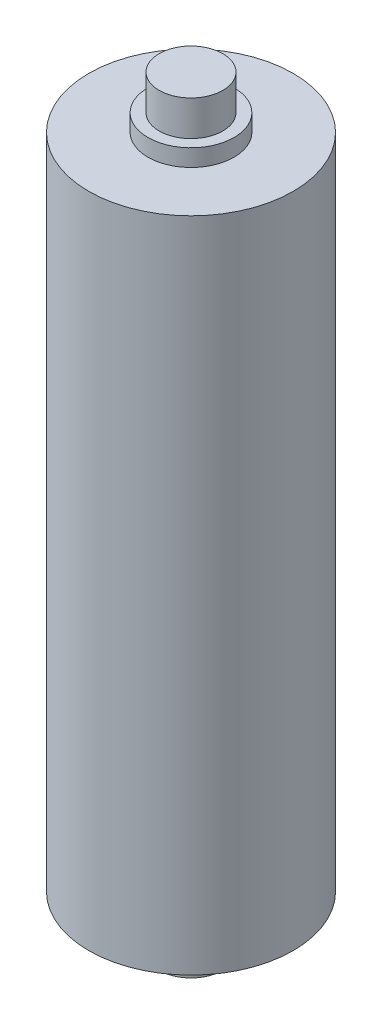
ISO-10303-21;
HEADER;
FILE_DESCRIPTION(('STEP AP214'),'2;1');
FILE_NAME('part.step','',(''),(''),'','','');
FILE_SCHEMA(('AUTOMOTIVE_DESIGN { 1 0 10303 214 1 1 1 1 }'));
ENDSEC;
DATA;
#1=APPLICATION_CONTEXT('core data for automotive mechanical design processes');
#2=APPLICATION_PROTOCOL_DEFINITION('international standard','automotive_design',2000,#1);
#3=PRODUCT_CONTEXT('',#1,'mechanical');
#4=PRODUCT('Part','Part','',(#3));
#5=PRODUCT_RELATED_PRODUCT_CATEGORY('part','',(#4));
#6=PRODUCT_DEFINITION_FORMATION('','',#4);
#7=PRODUCT_DEFINITION_CONTEXT('part definition',#1,'design');
#8=PRODUCT_DEFINITION('design','',#6,#7);
#9=PRODUCT_DEFINITION_SHAPE('','',#8);
#10=(LENGTH_UNIT() NAMED_UNIT(*) SI_UNIT(.MILLI.,.METRE.));
#11=(NAMED_UNIT(*) PLANE_ANGLE_UNIT() SI_UNIT($,.RADIAN.));
#12=(NAMED_UNIT(*) SI_UNIT($,.STERADIAN.) SOLID_ANGLE_UNIT());
#13=UNCERTAINTY_MEASURE_WITH_UNIT(LENGTH_MEASURE(1.E-05),#10,'distance_accuracy_value','');
#14=(GEOMETRIC_REPRESENTATION_CONTEXT(3) GLOBAL_UNCERTAINTY_ASSIGNED_CONTEXT((#13)) GLOBAL_UNIT_ASSIGNED_CONTEXT((#10,
#11,#12)) REPRESENTATION_CONTEXT('',''));
#15=CARTESIAN_POINT('',(0.,0.,0.));
#16=DIRECTION('',(0.,0.,1.));
#17=DIRECTION('',(1.,0.,0.));
#18=AXIS2_PLACEMENT_3D('',#15,#16,#17);
#19=CARTESIAN_POINT('',(0.,51.6,0.));
#20=DIRECTION('',(0.,-1.,0.));
#21=DIRECTION('',(0.,0.,-1.));
#22=AXIS2_PLACEMENT_3D('',#19,#20,#21);
#23=CYLINDRICAL_SURFACE('',#22,6.425);
#24=CARTESIAN_POINT('',(0.,49.05,0.));
#25=DIRECTION('',(0.,1.,0.));
#26=DIRECTION('',(0.,0.,1.));
#27=AXIS2_PLACEMENT_3D('',#24,#25,#26);
#28=CIRCLE('',#27,6.425);
#29=CARTESIAN_POINT('',(0.,49.05,6.425));
#30=VERTEX_POINT('',#29);
#31=EDGE_CURVE('E64',#30,#30,#28,.T.);
#32=ORIENTED_EDGE('',*,*,#31,.T.);
#33=EDGE_LOOP('',(#32));
#34=FACE_BOUND('',#33,.T.);
#35=CARTESIAN_POINT('',(0.,51.6,0.));
#36=DIRECTION('',(0.,1.,0.));
#37=DIRECTION('',(0.,0.,1.));
#38=AXIS2_PLACEMENT_3D('',#35,#36,#37);
#39=CIRCLE('',#38,6.425);
#40=CARTESIAN_POINT('',(0.,51.6,6.425));
#41=VERTEX_POINT('',#40);
#42=EDGE_CURVE('E42',#41,#41,#39,.T.);
#43=ORIENTED_EDGE('',*,*,#42,.F.);
#44=EDGE_LOOP('',(#43));
#45=FACE_BOUND('',#44,.T.);
#46=ADVANCED_FACE('F32',(#34,#45),#23,.T.);
#47=CARTESIAN_POINT('',(0.,51.6,0.));
#48=DIRECTION('',(0.,1.,0.));
#49=DIRECTION('',(0.,0.,1.));
#50=AXIS2_PLACEMENT_3D('',#47,#48,#49);
#51=PLANE('',#50);
#52=CARTESIAN_POINT('',(0.,51.6,0.));
#53=DIRECTION('',(0.,1.,0.));
#54=DIRECTION('',(0.,0.,1.));
#55=AXIS2_PLACEMENT_3D('',#52,#53,#54);
#56=CIRCLE('',#55,4.75);
#57=CARTESIAN_POINT('',(0.,51.6,4.75));
#58=VERTEX_POINT('',#57);
#59=EDGE_CURVE('E50',#58,#58,#56,.F.);
#60=ORIENTED_EDGE('',*,*,#59,.T.);
#61=EDGE_LOOP('',(#60));
#62=FACE_BOUND('',#61,.T.);
#63=ORIENTED_EDGE('',*,*,#42,.T.);
#64=EDGE_LOOP('',(#63));
#65=FACE_BOUND('',#64,.T.);
#66=ADVANCED_FACE('F96',(#62,#65),#51,.T.);
#67=CARTESIAN_POINT('',(0.,56.85,0.));
#68=DIRECTION('',(0.,-1.,0.));
#69=DIRECTION('',(0.,0.,-1.));
#70=AXIS2_PLACEMENT_3D('',#67,#68,#69);
#71=CYLINDRICAL_SURFACE('',#70,4.75);
#72=ORIENTED_EDGE('',*,*,#59,.F.);
#73=EDGE_LOOP('',(#72));
#74=FACE_BOUND('',#73,.T.);
#75=CARTESIAN_POINT('',(0.,56.85,0.));
#76=DIRECTION('',(0.,1.,0.));
#77=DIRECTION('',(0.,0.,1.));
#78=AXIS2_PLACEMENT_3D('',#75,#76,#77);
#79=CIRCLE('',#78,4.75);
#80=CARTESIAN_POINT('',(0.,56.85,4.75));
#81=VERTEX_POINT('',#80);
#82=EDGE_CURVE('E54',#81,#81,#79,.T.);
#83=ORIENTED_EDGE('',*,*,#82,.F.);
#84=EDGE_LOOP('',(#83));
#85=FACE_BOUND('',#84,.T.);
#86=ADVANCED_FACE('F101',(#74,#85),#71,.T.);
#87=CARTESIAN_POINT('',(0.,56.85,0.));
#88=DIRECTION('',(0.,1.,0.));
#89=DIRECTION('',(0.,0.,1.));
#90=AXIS2_PLACEMENT_3D('',#87,#88,#89);
#91=PLANE('',#90);
#92=ORIENTED_EDGE('',*,*,#82,.T.);
#93=EDGE_LOOP('',(#92));
#94=FACE_BOUND('',#93,.T.);
#95=ADVANCED_FACE('F82',(#94),#91,.T.);
#96=CARTESIAN_POINT('',(0.,49.05,0.));
#97=DIRECTION('',(0.,-1.,0.));
#98=DIRECTION('',(0.,0.,-1.));
#99=AXIS2_PLACEMENT_3D('',#96,#97,#98);
#100=CYLINDRICAL_SURFACE('',#99,15.25);
#101=CARTESIAN_POINT('',(0.,49.05,0.));
#102=DIRECTION('',(0.,1.,0.));
#103=DIRECTION('',(0.,0.,1.));
#104=AXIS2_PLACEMENT_3D('',#101,#102,#103);
#105=CIRCLE('',#104,15.25);
#106=CARTESIAN_POINT('',(0.,49.05,15.25));
#107=VERTEX_POINT('',#106);
#108=EDGE_CURVE('E58',#107,#107,#105,.T.);
#109=ORIENTED_EDGE('',*,*,#108,.F.);
#110=EDGE_LOOP('',(#109));
#111=FACE_BOUND('',#110,.T.);
#112=CARTESIAN_POINT('',(0.,-49.05,0.));
#113=DIRECTION('',(0.,1.,0.));
#114=DIRECTION('',(0.,0.,1.));
#115=AXIS2_PLACEMENT_3D('',#112,#113,#114);
#116=CIRCLE('',#115,15.25);
#117=CARTESIAN_POINT('',(0.,-49.05,15.25));
#118=VERTEX_POINT('',#117);
#119=EDGE_CURVE('E61',#118,#118,#116,.T.);
#120=ORIENTED_EDGE('',*,*,#119,.T.);
#121=EDGE_LOOP('',(#120));
#122=FACE_BOUND('',#121,.T.);
#123=ADVANCED_FACE('F76',(#111,#122),#100,.T.);
#124=CARTESIAN_POINT('',(0.,49.05,0.));
#125=DIRECTION('',(0.,1.,0.));
#126=DIRECTION('',(0.,0.,1.));
#127=AXIS2_PLACEMENT_3D('',#124,#125,#126);
#128=PLANE('',#127);
#129=ORIENTED_EDGE('',*,*,#31,.F.);
#130=EDGE_LOOP('',(#129));
#131=FACE_BOUND('',#130,.T.);
#132=ORIENTED_EDGE('',*,*,#108,.T.);
#133=EDGE_LOOP('',(#132));
#134=FACE_BOUND('',#133,.T.);
#135=ADVANCED_FACE('F72',(#131,#134),#128,.T.);
#136=CARTESIAN_POINT('',(0.,-49.05,0.));
#137=DIRECTION('',(0.,1.,0.));
#138=DIRECTION('',(0.,0.,1.));
#139=AXIS2_PLACEMENT_3D('',#136,#137,#138);
#140=PLANE('',#139);
#141=CARTESIAN_POINT('',(0.,-49.05,0.));
#142=DIRECTION('',(0.,1.,0.));
#143=DIRECTION('',(0.,0.,1.));
#144=AXIS2_PLACEMENT_3D('',#141,#142,#143);
#145=CIRCLE('',#144,6.425);
#146=CARTESIAN_POINT('',(0.,-49.05,6.425));
#147=VERTEX_POINT('',#146);
#148=EDGE_CURVE('E10',#147,#147,#145,.T.);
#149=ORIENTED_EDGE('',*,*,#148,.T.);
#150=EDGE_LOOP('',(#149));
#151=FACE_BOUND('',#150,.T.);
#152=ORIENTED_EDGE('',*,*,#119,.F.);
#153=EDGE_LOOP('',(#152));
#154=FACE_BOUND('',#153,.T.);
#155=ADVANCED_FACE('F75',(#151,#154),#140,.F.);
#156=CARTESIAN_POINT('',(0.,-56.85,0.));
#157=DIRECTION('',(0.,1.,0.));
#158=DIRECTION('',(0.,0.,1.));
#159=AXIS2_PLACEMENT_3D('',#156,#157,#158);
#160=PLANE('',#159);
#161=CARTESIAN_POINT('',(0.,-56.85,0.));
#162=DIRECTION('',(0.,1.,0.));
#163=DIRECTION('',(0.,0.,1.));
#164=AXIS2_PLACEMENT_3D('',#161,#162,#163);
#165=CIRCLE('',#164,4.75);
#166=CARTESIAN_POINT('',(0.,-56.85,4.75));
#167=VERTEX_POINT('',#166);
#168=EDGE_CURVE('E55',#167,#167,#165,.T.);
#169=ORIENTED_EDGE('',*,*,#168,.F.);
#170=EDGE_LOOP('',(#169));
#171=FACE_BOUND('',#170,.T.);
#172=ADVANCED_FACE('F87',(#171),#160,.F.);
#173=ORIENTED_EDGE('',*,*,#168,.T.);
#174=EDGE_LOOP('',(#173));
#175=FACE_BOUND('',#174,.T.);
#176=CARTESIAN_POINT('',(0.,-51.6,0.));
#177=DIRECTION('',(0.,1.,0.));
#178=DIRECTION('',(0.,0.,1.));
#179=AXIS2_PLACEMENT_3D('',#176,#177,#178);
#180=CIRCLE('',#179,4.75);
#181=CARTESIAN_POINT('',(0.,-51.6,4.75));
#182=VERTEX_POINT('',#181);
#183=EDGE_CURVE('E38',#182,#182,#180,.F.);
#184=ORIENTED_EDGE('',*,*,#183,.T.);
#185=EDGE_LOOP('',(#184));
#186=FACE_BOUND('',#185,.T.);
#187=ADVANCED_FACE('F92',(#175,#186),#71,.T.);
#188=CARTESIAN_POINT('',(0.,-51.6,0.));
#189=DIRECTION('',(0.,1.,0.));
#190=DIRECTION('',(0.,0.,1.));
#191=AXIS2_PLACEMENT_3D('',#188,#189,#190);
#192=PLANE('',#191);
#193=ORIENTED_EDGE('',*,*,#183,.F.);
#194=EDGE_LOOP('',(#193));
#195=FACE_BOUND('',#194,.T.);
#196=CARTESIAN_POINT('',(0.,-51.6,0.));
#197=DIRECTION('',(0.,1.,0.));
#198=DIRECTION('',(0.,0.,1.));
#199=AXIS2_PLACEMENT_3D('',#196,#197,#198);
#200=CIRCLE('',#199,6.425);
#201=CARTESIAN_POINT('',(0.,-51.6,6.425));
#202=VERTEX_POINT('',#201);
#203=EDGE_CURVE('E46',#202,#202,#200,.T.);
#204=ORIENTED_EDGE('',*,*,#203,.F.);
#205=EDGE_LOOP('',(#204));
#206=FACE_BOUND('',#205,.T.);
#207=ADVANCED_FACE('F105',(#195,#206),#192,.F.);
#208=ORIENTED_EDGE('',*,*,#203,.T.);
#209=EDGE_LOOP('',(#208));
#210=FACE_BOUND('',#209,.T.);
#211=ORIENTED_EDGE('',*,*,#148,.F.);
#212=EDGE_LOOP('',(#211));
#213=FACE_BOUND('',#212,.T.);
#214=ADVANCED_FACE('F97',(#210,#213),#23,.T.);
#215=CLOSED_SHELL('',(#46,#66,#86,#95,#123,#135,#155,#172,#187,#207,#214));
#216=MANIFOLD_SOLID_BREP('B2',#215);
#217=ADVANCED_BREP_SHAPE_REPRESENTATION('',(#18,#216),#14);
#218=SHAPE_DEFINITION_REPRESENTATION(#9,#217);
ENDSEC;
END-ISO-10303-21;
